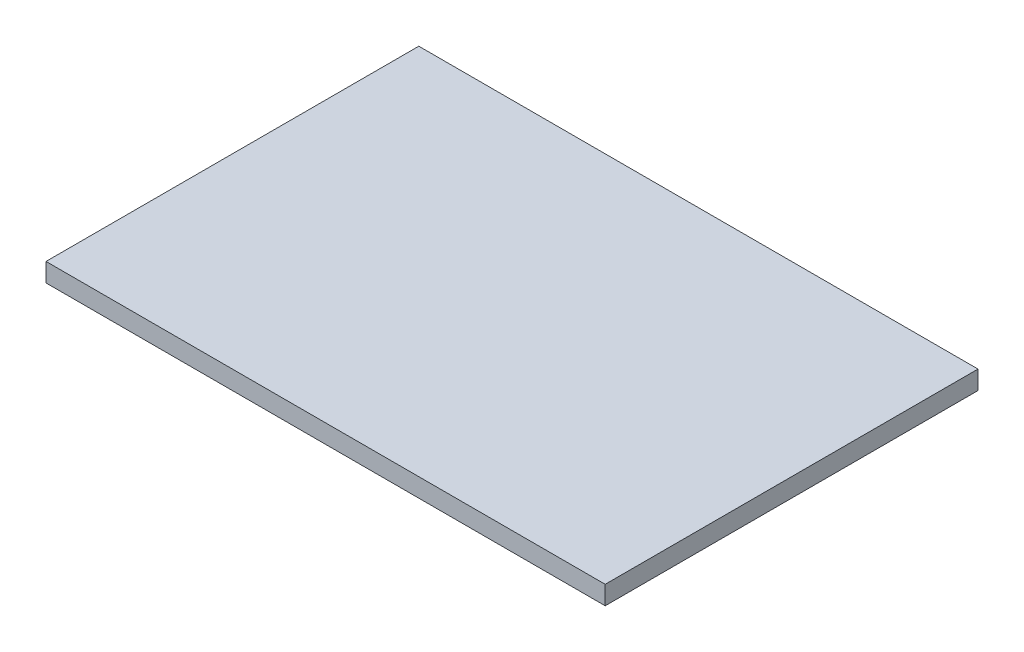
ISO-10303-21;
HEADER;
FILE_DESCRIPTION(('STEP AP214'),'2;1');
FILE_NAME('part.step','',(''),(''),'','','');
FILE_SCHEMA(('AUTOMOTIVE_DESIGN { 1 0 10303 214 1 1 1 1 }'));
ENDSEC;
DATA;
#1=APPLICATION_CONTEXT('core data for automotive mechanical design processes');
#2=APPLICATION_PROTOCOL_DEFINITION('international standard','automotive_design',2000,#1);
#3=PRODUCT_CONTEXT('',#1,'mechanical');
#4=PRODUCT('Part','Part','',(#3));
#5=PRODUCT_RELATED_PRODUCT_CATEGORY('part','',(#4));
#6=PRODUCT_DEFINITION_FORMATION('','',#4);
#7=PRODUCT_DEFINITION_CONTEXT('part definition',#1,'design');
#8=PRODUCT_DEFINITION('design','',#6,#7);
#9=PRODUCT_DEFINITION_SHAPE('','',#8);
#10=(LENGTH_UNIT() NAMED_UNIT(*) SI_UNIT(.MILLI.,.METRE.));
#11=(NAMED_UNIT(*) PLANE_ANGLE_UNIT() SI_UNIT($,.RADIAN.));
#12=(NAMED_UNIT(*) SI_UNIT($,.STERADIAN.) SOLID_ANGLE_UNIT());
#13=UNCERTAINTY_MEASURE_WITH_UNIT(LENGTH_MEASURE(1.E-05),#10,'distance_accuracy_value','');
#14=(GEOMETRIC_REPRESENTATION_CONTEXT(3) GLOBAL_UNCERTAINTY_ASSIGNED_CONTEXT((#13)) GLOBAL_UNIT_ASSIGNED_CONTEXT((#10,
#11,#12)) REPRESENTATION_CONTEXT('',''));
#15=CARTESIAN_POINT('',(0.,0.,0.));
#16=DIRECTION('',(0.,0.,1.));
#17=DIRECTION('',(1.,0.,0.));
#18=AXIS2_PLACEMENT_3D('',#15,#16,#17);
#19=CARTESIAN_POINT('',(-150.,4.99999999999998,0.));
#20=DIRECTION('',(0.,0.,-1.));
#21=DIRECTION('',(-1.,0.,0.));
#22=AXIS2_PLACEMENT_3D('',#19,#20,#21);
#23=PLANE('',#22);
#24=DIRECTION('',(0.,1.,0.));
#25=VECTOR('',#24,1.);
#26=CARTESIAN_POINT('',(0.,4.99999999999998,0.));
#27=LINE('',#26,#25);
#28=CARTESIAN_POINT('',(0.,0.,0.));
#29=VERTEX_POINT('',#28);
#30=CARTESIAN_POINT('',(0.,4.99999999999998,0.));
#31=VERTEX_POINT('',#30);
#32=EDGE_CURVE('E109',#29,#31,#27,.T.);
#33=ORIENTED_EDGE('',*,*,#32,.F.);
#34=DIRECTION('',(1.,0.,0.));
#35=VECTOR('',#34,1.);
#36=CARTESIAN_POINT('',(-150.,0.,0.));
#37=LINE('',#36,#35);
#38=CARTESIAN_POINT('',(-150.,0.,0.));
#39=VERTEX_POINT('',#38);
#40=EDGE_CURVE('E11',#39,#29,#37,.T.);
#41=ORIENTED_EDGE('',*,*,#40,.F.);
#42=DIRECTION('',(0.,1.,0.));
#43=VECTOR('',#42,1.);
#44=CARTESIAN_POINT('',(-150.,4.99999999999998,0.));
#45=LINE('',#44,#43);
#46=CARTESIAN_POINT('',(-150.,4.99999999999998,0.));
#47=VERTEX_POINT('',#46);
#48=EDGE_CURVE('E101',#39,#47,#45,.T.);
#49=ORIENTED_EDGE('',*,*,#48,.T.);
#50=DIRECTION('',(1.,0.,0.));
#51=VECTOR('',#50,1.);
#52=CARTESIAN_POINT('',(-150.,4.99999999999998,0.));
#53=LINE('',#52,#51);
#54=EDGE_CURVE('E42',#47,#31,#53,.T.);
#55=ORIENTED_EDGE('',*,*,#54,.T.);
#56=EDGE_LOOP('',(#33,#41,#49,#55));
#57=FACE_BOUND('',#56,.T.);
#58=ADVANCED_FACE('F39',(#57),#23,.T.);
#59=CARTESIAN_POINT('',(-150.,0.,0.));
#60=DIRECTION('',(0.,-1.,0.));
#61=DIRECTION('',(0.,0.,-1.));
#62=AXIS2_PLACEMENT_3D('',#59,#60,#61);
#63=PLANE('',#62);
#64=DIRECTION('',(0.,0.,-1.));
#65=VECTOR('',#64,1.);
#66=CARTESIAN_POINT('',(0.,0.,0.));
#67=LINE('',#66,#65);
#68=CARTESIAN_POINT('',(0.,0.,100.));
#69=VERTEX_POINT('',#68);
#70=EDGE_CURVE('E104',#69,#29,#67,.T.);
#71=ORIENTED_EDGE('',*,*,#70,.F.);
#72=DIRECTION('',(1.,0.,0.));
#73=VECTOR('',#72,1.);
#74=CARTESIAN_POINT('',(-150.,0.,100.));
#75=LINE('',#74,#73);
#76=CARTESIAN_POINT('',(-150.,0.,100.));
#77=VERTEX_POINT('',#76);
#78=EDGE_CURVE('E49',#77,#69,#75,.T.);
#79=ORIENTED_EDGE('',*,*,#78,.F.);
#80=DIRECTION('',(0.,0.,-1.));
#81=VECTOR('',#80,1.);
#82=CARTESIAN_POINT('',(-150.,0.,0.));
#83=LINE('',#82,#81);
#84=EDGE_CURVE('E96',#77,#39,#83,.T.);
#85=ORIENTED_EDGE('',*,*,#84,.T.);
#86=ORIENTED_EDGE('',*,*,#40,.T.);
#87=EDGE_LOOP('',(#71,#79,#85,#86));
#88=FACE_BOUND('',#87,.T.);
#89=ADVANCED_FACE('F125',(#88),#63,.T.);
#90=CARTESIAN_POINT('',(-150.,0.,100.));
#91=DIRECTION('',(0.,0.,1.));
#92=DIRECTION('',(1.,0.,0.));
#93=AXIS2_PLACEMENT_3D('',#90,#91,#92);
#94=PLANE('',#93);
#95=DIRECTION('',(0.,-1.,0.));
#96=VECTOR('',#95,1.);
#97=CARTESIAN_POINT('',(0.,0.,100.));
#98=LINE('',#97,#96);
#99=CARTESIAN_POINT('',(0.,4.99999999999998,100.));
#100=VERTEX_POINT('',#99);
#101=EDGE_CURVE('E90',#100,#69,#98,.T.);
#102=ORIENTED_EDGE('',*,*,#101,.F.);
#103=DIRECTION('',(1.,0.,0.));
#104=VECTOR('',#103,1.);
#105=CARTESIAN_POINT('',(-150.,4.99999999999998,100.));
#106=LINE('',#105,#104);
#107=CARTESIAN_POINT('',(-150.,4.99999999999998,100.));
#108=VERTEX_POINT('',#107);
#109=EDGE_CURVE('E85',#108,#100,#106,.T.);
#110=ORIENTED_EDGE('',*,*,#109,.F.);
#111=DIRECTION('',(0.,-1.,0.));
#112=VECTOR('',#111,1.);
#113=CARTESIAN_POINT('',(-150.,0.,100.));
#114=LINE('',#113,#112);
#115=EDGE_CURVE('E88',#108,#77,#114,.T.);
#116=ORIENTED_EDGE('',*,*,#115,.T.);
#117=ORIENTED_EDGE('',*,*,#78,.T.);
#118=EDGE_LOOP('',(#102,#110,#116,#117));
#119=FACE_BOUND('',#118,.T.);
#120=ADVANCED_FACE('F87',(#119),#94,.T.);
#121=CARTESIAN_POINT('',(-150.,4.99999999999998,100.));
#122=DIRECTION('',(0.,1.,0.));
#123=DIRECTION('',(0.,0.,1.));
#124=AXIS2_PLACEMENT_3D('',#121,#122,#123);
#125=PLANE('',#124);
#126=DIRECTION('',(0.,0.,1.));
#127=VECTOR('',#126,1.);
#128=CARTESIAN_POINT('',(0.,4.99999999999998,100.));
#129=LINE('',#128,#127);
#130=EDGE_CURVE('E113',#31,#100,#129,.T.);
#131=ORIENTED_EDGE('',*,*,#130,.F.);
#132=ORIENTED_EDGE('',*,*,#54,.F.);
#133=DIRECTION('',(0.,0.,1.));
#134=VECTOR('',#133,1.);
#135=CARTESIAN_POINT('',(-150.,4.99999999999998,100.));
#136=LINE('',#135,#134);
#137=EDGE_CURVE('E95',#47,#108,#136,.T.);
#138=ORIENTED_EDGE('',*,*,#137,.T.);
#139=ORIENTED_EDGE('',*,*,#109,.T.);
#140=EDGE_LOOP('',(#131,#132,#138,#139));
#141=FACE_BOUND('',#140,.T.);
#142=ADVANCED_FACE('F99',(#141),#125,.T.);
#143=CARTESIAN_POINT('',(-150.,0.,0.));
#144=DIRECTION('',(-1.,0.,0.));
#145=DIRECTION('',(0.,0.,1.));
#146=AXIS2_PLACEMENT_3D('',#143,#144,#145);
#147=PLANE('',#146);
#148=ORIENTED_EDGE('',*,*,#48,.F.);
#149=ORIENTED_EDGE('',*,*,#84,.F.);
#150=ORIENTED_EDGE('',*,*,#115,.F.);
#151=ORIENTED_EDGE('',*,*,#137,.F.);
#152=EDGE_LOOP('',(#148,#149,#150,#151));
#153=FACE_BOUND('',#152,.T.);
#154=ADVANCED_FACE('F94',(#153),#147,.T.);
#155=CARTESIAN_POINT('',(0.,0.,0.));
#156=DIRECTION('',(-1.,0.,0.));
#157=DIRECTION('',(0.,0.,1.));
#158=AXIS2_PLACEMENT_3D('',#155,#156,#157);
#159=PLANE('',#158);
#160=ORIENTED_EDGE('',*,*,#32,.T.);
#161=ORIENTED_EDGE('',*,*,#130,.T.);
#162=ORIENTED_EDGE('',*,*,#101,.T.);
#163=ORIENTED_EDGE('',*,*,#70,.T.);
#164=EDGE_LOOP('',(#160,#161,#162,#163));
#165=FACE_BOUND('',#164,.T.);
#166=ADVANCED_FACE('F124',(#165),#159,.F.);
#167=CLOSED_SHELL('',(#58,#89,#120,#142,#154,#166));
#168=MANIFOLD_SOLID_BREP('B2',#167);
#169=ADVANCED_BREP_SHAPE_REPRESENTATION('',(#18,#168),#14);
#170=SHAPE_DEFINITION_REPRESENTATION(#9,#169);
ENDSEC;
END-ISO-10303-21;
